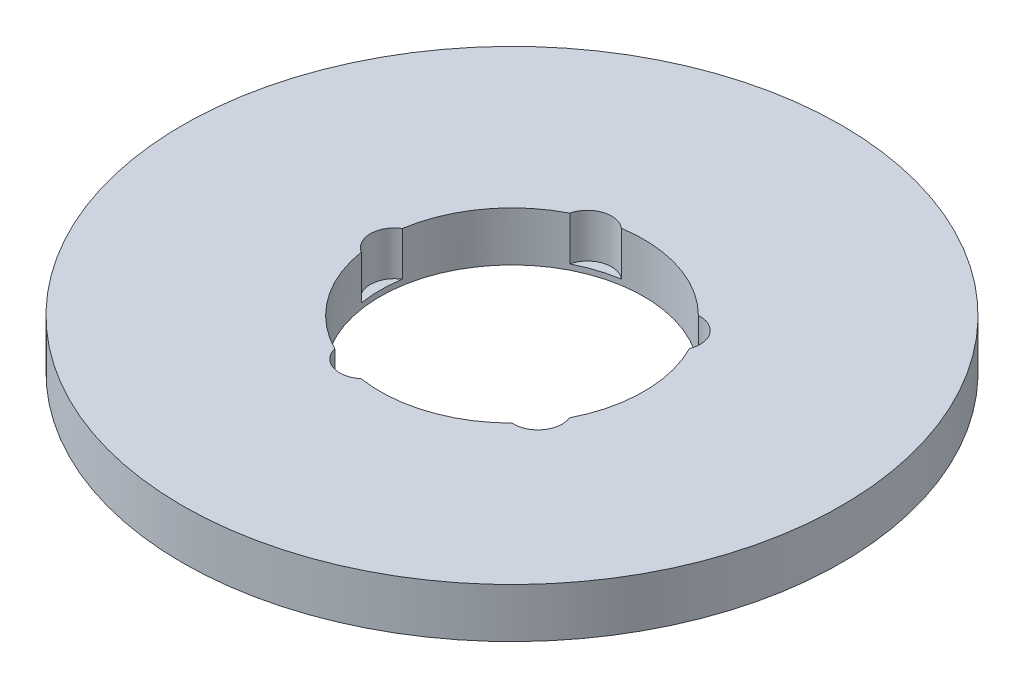
ISO-10303-21;
HEADER;
FILE_DESCRIPTION(('STEP AP214'),'2;1');
FILE_NAME('part.step','',(''),(''),'','','');
FILE_SCHEMA(('AUTOMOTIVE_DESIGN { 1 0 10303 214 1 1 1 1 }'));
ENDSEC;
DATA;
#1=APPLICATION_CONTEXT('core data for automotive mechanical design processes');
#2=APPLICATION_PROTOCOL_DEFINITION('international standard','automotive_design',2000,#1);
#3=PRODUCT_CONTEXT('',#1,'mechanical');
#4=PRODUCT('Part','Part','',(#3));
#5=PRODUCT_RELATED_PRODUCT_CATEGORY('part','',(#4));
#6=PRODUCT_DEFINITION_FORMATION('','',#4);
#7=PRODUCT_DEFINITION_CONTEXT('part definition',#1,'design');
#8=PRODUCT_DEFINITION('design','',#6,#7);
#9=PRODUCT_DEFINITION_SHAPE('','',#8);
#10=(LENGTH_UNIT() NAMED_UNIT(*) SI_UNIT(.MILLI.,.METRE.));
#11=(NAMED_UNIT(*) PLANE_ANGLE_UNIT() SI_UNIT($,.RADIAN.));
#12=(NAMED_UNIT(*) SI_UNIT($,.STERADIAN.) SOLID_ANGLE_UNIT());
#13=UNCERTAINTY_MEASURE_WITH_UNIT(LENGTH_MEASURE(1.E-05),#10,'distance_accuracy_value','');
#14=(GEOMETRIC_REPRESENTATION_CONTEXT(3) GLOBAL_UNCERTAINTY_ASSIGNED_CONTEXT((#13)) GLOBAL_UNIT_ASSIGNED_CONTEXT((#10,
#11,#12)) REPRESENTATION_CONTEXT('',''));
#15=CARTESIAN_POINT('',(0.,0.,0.));
#16=DIRECTION('',(0.,0.,1.));
#17=DIRECTION('',(1.,0.,0.));
#18=AXIS2_PLACEMENT_3D('',#15,#16,#17);
#19=CARTESIAN_POINT('',(0.,15.,0.));
#20=DIRECTION('',(0.,-1.,0.));
#21=DIRECTION('',(0.,0.,-1.));
#22=AXIS2_PLACEMENT_3D('',#19,#20,#21);
#23=CYLINDRICAL_SURFACE('',#22,100.);
#24=CARTESIAN_POINT('',(0.,15.,0.));
#25=DIRECTION('',(0.,1.,0.));
#26=DIRECTION('',(0.,0.,1.));
#27=AXIS2_PLACEMENT_3D('',#24,#25,#26);
#28=CIRCLE('',#27,100.);
#29=CARTESIAN_POINT('',(0.,15.,100.));
#30=VERTEX_POINT('',#29);
#31=EDGE_CURVE('E151',#30,#30,#28,.T.);
#32=ORIENTED_EDGE('',*,*,#31,.F.);
#33=EDGE_LOOP('',(#32));
#34=FACE_BOUND('',#33,.T.);
#35=CARTESIAN_POINT('',(0.,0.,0.));
#36=DIRECTION('',(0.,1.,0.));
#37=DIRECTION('',(0.,0.,1.));
#38=AXIS2_PLACEMENT_3D('',#35,#36,#37);
#39=CIRCLE('',#38,100.);
#40=CARTESIAN_POINT('',(0.,0.,100.));
#41=VERTEX_POINT('',#40);
#42=EDGE_CURVE('E150',#41,#41,#39,.T.);
#43=ORIENTED_EDGE('',*,*,#42,.T.);
#44=EDGE_LOOP('',(#43));
#45=FACE_BOUND('',#44,.T.);
#46=ADVANCED_FACE('F39',(#34,#45),#23,.T.);
#47=CARTESIAN_POINT('',(0.,15.,0.));
#48=DIRECTION('',(0.,1.,0.));
#49=DIRECTION('',(0.,0.,1.));
#50=AXIS2_PLACEMENT_3D('',#47,#48,#49);
#51=PLANE('',#50);
#52=CARTESIAN_POINT('',(-11.0185160792969,15.,-33.9115055413515));
#53=DIRECTION('',(0.,1.,0.));
#54=DIRECTION('',(-0.95105651629515,0.,0.309016994374958));
#55=AXIS2_PLACEMENT_3D('',#52,#53,#54);
#56=CIRCLE('',#55,7.31653374537758);
#57=CARTESIAN_POINT('',(-6.29754836445653,15.,-39.5011504211881));
#58=VERTEX_POINT('',#57);
#59=CARTESIAN_POINT('',(-18.1233700164183,15.,-35.658708042328));
#60=VERTEX_POINT('',#59);
#61=EDGE_CURVE('E196',#58,#60,#56,.T.);
#62=ORIENTED_EDGE('',*,*,#61,.F.);
#63=CARTESIAN_POINT('',(0.,15.,0.));
#64=DIRECTION('',(0.,1.,0.));
#65=DIRECTION('',(0.,0.,1.));
#66=AXIS2_PLACEMENT_3D('',#63,#64,#65);
#67=CIRCLE('',#66,40.);
#68=CARTESIAN_POINT('',(28.3130173159039,15.,-28.2554959338767));
#69=VERTEX_POINT('',#68);
#70=EDGE_CURVE('E156',#69,#58,#67,.T.);
#71=ORIENTED_EDGE('',*,*,#70,.F.);
#72=CARTESIAN_POINT('',(28.8468496011852,15.,-20.958463034236));
#73=DIRECTION('',(0.,1.,0.));
#74=DIRECTION('',(-0.58778525229248,0.,-0.809016994374942));
#75=AXIS2_PLACEMENT_3D('',#72,#73,#74);
#76=CIRCLE('',#75,7.31653374537758);
#77=CARTESIAN_POINT('',(35.6217770417108,15.,-18.1958511862084));
#78=VERTEX_POINT('',#77);
#79=EDGE_CURVE('E254',#78,#69,#76,.T.);
#80=ORIENTED_EDGE('',*,*,#79,.F.);
#81=CARTESIAN_POINT('',(35.6217770417111,15.,18.1958511862079));
#82=VERTEX_POINT('',#81);
#83=EDGE_CURVE('E153',#82,#78,#67,.T.);
#84=ORIENTED_EDGE('',*,*,#83,.F.);
#85=CARTESIAN_POINT('',(28.8468496011855,15.,20.9584630342355));
#86=DIRECTION('',(0.,1.,0.));
#87=DIRECTION('',(0.587785252292469,0.,-0.809016994374951));
#88=AXIS2_PLACEMENT_3D('',#85,#86,#87);
#89=CIRCLE('',#88,7.31653374537758);
#90=CARTESIAN_POINT('',(28.3130173159043,15.,28.2554959338763));
#91=VERTEX_POINT('',#90);
#92=EDGE_CURVE('E248',#91,#82,#89,.T.);
#93=ORIENTED_EDGE('',*,*,#92,.F.);
#94=CARTESIAN_POINT('',(-6.29754836445596,15.,39.5011504211882));
#95=VERTEX_POINT('',#94);
#96=EDGE_CURVE('E140',#95,#91,#67,.T.);
#97=ORIENTED_EDGE('',*,*,#96,.F.);
#98=CARTESIAN_POINT('',(-11.0185160792964,15.,33.9115055413516));
#99=DIRECTION('',(0.,1.,0.));
#100=DIRECTION('',(0.951056516295155,0.,0.309016994374945));
#101=AXIS2_PLACEMENT_3D('',#98,#99,#100);
#102=CIRCLE('',#101,7.31653374537758);
#103=CARTESIAN_POINT('',(-18.1233700164178,15.,35.6587080423283));
#104=VERTEX_POINT('',#103);
#105=EDGE_CURVE('E117',#104,#95,#102,.T.);
#106=ORIENTED_EDGE('',*,*,#105,.F.);
#107=CARTESIAN_POINT('',(-39.5138759767412,15.,6.21720236880842));
#108=VERTEX_POINT('',#107);
#109=EDGE_CURVE('E133',#108,#104,#67,.T.);
#110=ORIENTED_EDGE('',*,*,#109,.F.);
#111=CARTESIAN_POINT('',(-35.6566670437779,15.,0.));
#112=DIRECTION('',(0.,1.,0.));
#113=DIRECTION('',(0.,0.,1.));
#114=AXIS2_PLACEMENT_3D('',#111,#112,#113);
#115=CIRCLE('',#114,7.31653374537758);
#116=CARTESIAN_POINT('',(-39.5138759767412,15.,-6.21720236880842));
#117=VERTEX_POINT('',#116);
#118=EDGE_CURVE('E170',#117,#108,#115,.T.);
#119=ORIENTED_EDGE('',*,*,#118,.F.);
#120=EDGE_CURVE('E149',#60,#117,#67,.T.);
#121=ORIENTED_EDGE('',*,*,#120,.F.);
#122=EDGE_LOOP('',(#62,#71,#80,#84,#93,#97,#106,#110,#119,#121));
#123=FACE_BOUND('',#122,.T.);
#124=ORIENTED_EDGE('',*,*,#31,.T.);
#125=EDGE_LOOP('',(#124));
#126=FACE_BOUND('',#125,.T.);
#127=ADVANCED_FACE('F131',(#123,#126),#51,.T.);
#128=CARTESIAN_POINT('',(0.,0.,0.));
#129=DIRECTION('',(0.,1.,0.));
#130=DIRECTION('',(0.,0.,1.));
#131=AXIS2_PLACEMENT_3D('',#128,#129,#130);
#132=PLANE('',#131);
#133=CARTESIAN_POINT('',(0.,0.,0.));
#134=DIRECTION('',(0.,1.,0.));
#135=DIRECTION('',(0.,0.,1.));
#136=AXIS2_PLACEMENT_3D('',#133,#134,#135);
#137=CIRCLE('',#136,40.);
#138=CARTESIAN_POINT('',(0.,0.,40.));
#139=VERTEX_POINT('',#138);
#140=EDGE_CURVE('E160',#139,#139,#137,.T.);
#141=ORIENTED_EDGE('',*,*,#140,.T.);
#142=EDGE_LOOP('',(#141));
#143=FACE_BOUND('',#142,.T.);
#144=ORIENTED_EDGE('',*,*,#42,.F.);
#145=EDGE_LOOP('',(#144));
#146=FACE_BOUND('',#145,.T.);
#147=ADVANCED_FACE('F212',(#143,#146),#132,.F.);
#148=CARTESIAN_POINT('',(0.,15.,0.));
#149=DIRECTION('',(0.,-1.,0.));
#150=DIRECTION('',(0.,0.,-1.));
#151=AXIS2_PLACEMENT_3D('',#148,#149,#150);
#152=CYLINDRICAL_SURFACE('',#151,40.);
#153=DIRECTION('',(0.,1.,0.));
#154=VECTOR('',#153,1.);
#155=CARTESIAN_POINT('',(-6.29754836445653,8.32919586123089,-39.5011504211881));
#156=LINE('',#155,#154);
#157=CARTESIAN_POINT('',(-6.29754836445653,1.65839172246177,-39.5011504211881));
#158=VERTEX_POINT('',#157);
#159=EDGE_CURVE('E11',#158,#58,#156,.T.);
#160=ORIENTED_EDGE('',*,*,#159,.F.);
#161=CARTESIAN_POINT('',(0.,1.65839172246177,0.));
#162=DIRECTION('',(0.,1.,0.));
#163=DIRECTION('',(0.,0.,1.));
#164=AXIS2_PLACEMENT_3D('',#161,#162,#163);
#165=CIRCLE('',#164,40.);
#166=CARTESIAN_POINT('',(-18.1233700164183,1.65839172246177,-35.658708042328));
#167=VERTEX_POINT('',#166);
#168=EDGE_CURVE('E193',#158,#167,#165,.T.);
#169=ORIENTED_EDGE('',*,*,#168,.T.);
#170=DIRECTION('',(0.,1.,0.));
#171=VECTOR('',#170,1.);
#172=CARTESIAN_POINT('',(-18.1233700164183,8.32919586123089,-35.658708042328));
#173=LINE('',#172,#171);
#174=EDGE_CURVE('E46',#60,#167,#173,.F.);
#175=ORIENTED_EDGE('',*,*,#174,.F.);
#176=ORIENTED_EDGE('',*,*,#120,.T.);
#177=DIRECTION('',(0.,1.,0.));
#178=VECTOR('',#177,1.);
#179=CARTESIAN_POINT('',(-39.5138759767412,8.32919586123089,-6.21720236880842));
#180=LINE('',#179,#178);
#181=CARTESIAN_POINT('',(-39.5138759767412,1.65839172246177,-6.21720236880842));
#182=VERTEX_POINT('',#181);
#183=EDGE_CURVE('E174',#182,#117,#180,.T.);
#184=ORIENTED_EDGE('',*,*,#183,.F.);
#185=CARTESIAN_POINT('',(0.,1.65839172246177,0.));
#186=DIRECTION('',(0.,1.,0.));
#187=DIRECTION('',(0.,0.,1.));
#188=AXIS2_PLACEMENT_3D('',#185,#186,#187);
#189=CIRCLE('',#188,40.);
#190=CARTESIAN_POINT('',(-39.5138759767412,1.65839172246177,6.21720236880842));
#191=VERTEX_POINT('',#190);
#192=EDGE_CURVE('E171',#182,#191,#189,.T.);
#193=ORIENTED_EDGE('',*,*,#192,.T.);
#194=DIRECTION('',(0.,1.,0.));
#195=VECTOR('',#194,1.);
#196=CARTESIAN_POINT('',(-39.5138759767412,8.32919586123089,6.21720236880842));
#197=LINE('',#196,#195);
#198=EDGE_CURVE('E148',#108,#191,#197,.F.);
#199=ORIENTED_EDGE('',*,*,#198,.F.);
#200=ORIENTED_EDGE('',*,*,#109,.T.);
#201=DIRECTION('',(0.,1.,0.));
#202=VECTOR('',#201,1.);
#203=CARTESIAN_POINT('',(-18.1233700164178,8.32919586123089,35.6587080423283));
#204=LINE('',#203,#202);
#205=CARTESIAN_POINT('',(-18.1233700164178,1.65839172246177,35.6587080423283));
#206=VERTEX_POINT('',#205);
#207=EDGE_CURVE('E111',#206,#104,#204,.T.);
#208=ORIENTED_EDGE('',*,*,#207,.F.);
#209=CARTESIAN_POINT('',(0.,1.65839172246177,0.));
#210=DIRECTION('',(0.,1.,0.));
#211=DIRECTION('',(0.,0.,1.));
#212=AXIS2_PLACEMENT_3D('',#209,#210,#211);
#213=CIRCLE('',#212,40.);
#214=CARTESIAN_POINT('',(-6.29754836445596,1.65839172246177,39.5011504211882));
#215=VERTEX_POINT('',#214);
#216=EDGE_CURVE('E180',#206,#215,#213,.T.);
#217=ORIENTED_EDGE('',*,*,#216,.T.);
#218=DIRECTION('',(0.,1.,0.));
#219=VECTOR('',#218,1.);
#220=CARTESIAN_POINT('',(-6.29754836445597,8.32919586123089,39.5011504211882));
#221=LINE('',#220,#219);
#222=EDGE_CURVE('E124',#95,#215,#221,.F.);
#223=ORIENTED_EDGE('',*,*,#222,.F.);
#224=ORIENTED_EDGE('',*,*,#96,.T.);
#225=DIRECTION('',(0.,1.,0.));
#226=VECTOR('',#225,1.);
#227=CARTESIAN_POINT('',(28.3130173159043,8.32919586123089,28.2554959338763));
#228=LINE('',#227,#226);
#229=CARTESIAN_POINT('',(28.3130173159043,1.65839172246177,28.2554959338763));
#230=VERTEX_POINT('',#229);
#231=EDGE_CURVE('E183',#230,#91,#228,.T.);
#232=ORIENTED_EDGE('',*,*,#231,.F.);
#233=CARTESIAN_POINT('',(0.,1.65839172246177,0.));
#234=DIRECTION('',(0.,1.,0.));
#235=DIRECTION('',(0.,0.,1.));
#236=AXIS2_PLACEMENT_3D('',#233,#234,#235);
#237=CIRCLE('',#236,40.);
#238=CARTESIAN_POINT('',(35.6217770417111,1.65839172246177,18.1958511862079));
#239=VERTEX_POINT('',#238);
#240=EDGE_CURVE('E123',#230,#239,#237,.T.);
#241=ORIENTED_EDGE('',*,*,#240,.T.);
#242=DIRECTION('',(0.,1.,0.));
#243=VECTOR('',#242,1.);
#244=CARTESIAN_POINT('',(35.6217770417111,8.32919586123089,18.1958511862079));
#245=LINE('',#244,#243);
#246=EDGE_CURVE('E185',#82,#239,#245,.F.);
#247=ORIENTED_EDGE('',*,*,#246,.F.);
#248=ORIENTED_EDGE('',*,*,#83,.T.);
#249=DIRECTION('',(0.,1.,0.));
#250=VECTOR('',#249,1.);
#251=CARTESIAN_POINT('',(35.6217770417108,8.32919586123089,-18.1958511862084));
#252=LINE('',#251,#250);
#253=CARTESIAN_POINT('',(35.6217770417108,1.65839172246177,-18.1958511862084));
#254=VERTEX_POINT('',#253);
#255=EDGE_CURVE('E195',#254,#78,#252,.T.);
#256=ORIENTED_EDGE('',*,*,#255,.F.);
#257=CARTESIAN_POINT('',(0.,1.65839172246177,0.));
#258=DIRECTION('',(0.,1.,0.));
#259=DIRECTION('',(0.,0.,1.));
#260=AXIS2_PLACEMENT_3D('',#257,#258,#259);
#261=CIRCLE('',#260,40.);
#262=CARTESIAN_POINT('',(28.3130173159039,1.65839172246177,-28.2554959338767));
#263=VERTEX_POINT('',#262);
#264=EDGE_CURVE('E190',#254,#263,#261,.T.);
#265=ORIENTED_EDGE('',*,*,#264,.T.);
#266=DIRECTION('',(0.,1.,0.));
#267=VECTOR('',#266,1.);
#268=CARTESIAN_POINT('',(28.3130173159039,8.32919586123089,-28.2554959338767));
#269=LINE('',#268,#267);
#270=EDGE_CURVE('E189',#69,#263,#269,.F.);
#271=ORIENTED_EDGE('',*,*,#270,.F.);
#272=ORIENTED_EDGE('',*,*,#70,.T.);
#273=EDGE_LOOP('',(#160,#169,#175,#176,#184,#193,#199,#200,#208,#217,#223,#224,#232,#241,#247,
#248,#256,#265,#271,#272));
#274=FACE_BOUND('',#273,.T.);
#275=ORIENTED_EDGE('',*,*,#140,.F.);
#276=EDGE_LOOP('',(#275));
#277=FACE_BOUND('',#276,.T.);
#278=ADVANCED_FACE('F142',(#274,#277),#152,.F.);
#279=CARTESIAN_POINT('',(-35.6566670437779,1.65839172246177,0.));
#280=DIRECTION('',(0.,1.,0.));
#281=DIRECTION('',(0.,0.,1.));
#282=AXIS2_PLACEMENT_3D('',#279,#280,#281);
#283=CYLINDRICAL_SURFACE('',#282,7.31653374537758);
#284=ORIENTED_EDGE('',*,*,#183,.T.);
#285=ORIENTED_EDGE('',*,*,#118,.T.);
#286=ORIENTED_EDGE('',*,*,#198,.T.);
#287=CARTESIAN_POINT('',(-35.6566670437779,1.65839172246177,0.));
#288=DIRECTION('',(0.,1.,0.));
#289=DIRECTION('',(0.,0.,1.));
#290=AXIS2_PLACEMENT_3D('',#287,#288,#289);
#291=CIRCLE('',#290,7.31653374537758);
#292=EDGE_CURVE('E163',#182,#191,#291,.T.);
#293=ORIENTED_EDGE('',*,*,#292,.F.);
#294=EDGE_LOOP('',(#284,#285,#286,#293));
#295=FACE_BOUND('',#294,.T.);
#296=ADVANCED_FACE('F221',(#295),#283,.F.);
#297=CARTESIAN_POINT('',(-35.6566670437779,1.65839172246177,0.));
#298=DIRECTION('',(0.,1.,0.));
#299=DIRECTION('',(0.,0.,1.));
#300=AXIS2_PLACEMENT_3D('',#297,#298,#299);
#301=PLANE('',#300);
#302=ORIENTED_EDGE('',*,*,#292,.T.);
#303=ORIENTED_EDGE('',*,*,#192,.F.);
#304=EDGE_LOOP('',(#302,#303));
#305=FACE_BOUND('',#304,.T.);
#306=ADVANCED_FACE('F227',(#305),#301,.T.);
#307=CARTESIAN_POINT('',(-11.0185160792964,1.65839172246177,33.9115055413516));
#308=DIRECTION('',(0.,1.,0.));
#309=DIRECTION('',(0.,0.,1.));
#310=AXIS2_PLACEMENT_3D('',#307,#308,#309);
#311=CYLINDRICAL_SURFACE('',#310,7.31653374537758);
#312=ORIENTED_EDGE('',*,*,#207,.T.);
#313=ORIENTED_EDGE('',*,*,#105,.T.);
#314=ORIENTED_EDGE('',*,*,#222,.T.);
#315=CARTESIAN_POINT('',(-11.0185160792964,1.65839172246177,33.9115055413516));
#316=DIRECTION('',(0.,1.,0.));
#317=DIRECTION('',(0.951056516295155,0.,0.309016994374945));
#318=AXIS2_PLACEMENT_3D('',#315,#316,#317);
#319=CIRCLE('',#318,7.31653374537758);
#320=EDGE_CURVE('E119',#206,#215,#319,.T.);
#321=ORIENTED_EDGE('',*,*,#320,.F.);
#322=EDGE_LOOP('',(#312,#313,#314,#321));
#323=FACE_BOUND('',#322,.T.);
#324=ADVANCED_FACE('F116',(#323),#311,.F.);
#325=CARTESIAN_POINT('',(-11.0185160792964,1.65839172246177,33.9115055413516));
#326=DIRECTION('',(0.,1.,0.));
#327=DIRECTION('',(0.951056516295155,0.,0.309016994374945));
#328=AXIS2_PLACEMENT_3D('',#325,#326,#327);
#329=PLANE('',#328);
#330=ORIENTED_EDGE('',*,*,#320,.T.);
#331=ORIENTED_EDGE('',*,*,#216,.F.);
#332=EDGE_LOOP('',(#330,#331));
#333=FACE_BOUND('',#332,.T.);
#334=ADVANCED_FACE('F234',(#333),#329,.T.);
#335=CARTESIAN_POINT('',(28.8468496011855,1.65839172246177,20.9584630342355));
#336=DIRECTION('',(0.,1.,0.));
#337=DIRECTION('',(0.,0.,1.));
#338=AXIS2_PLACEMENT_3D('',#335,#336,#337);
#339=CYLINDRICAL_SURFACE('',#338,7.31653374537758);
#340=ORIENTED_EDGE('',*,*,#231,.T.);
#341=ORIENTED_EDGE('',*,*,#92,.T.);
#342=ORIENTED_EDGE('',*,*,#246,.T.);
#343=CARTESIAN_POINT('',(28.8468496011855,1.65839172246177,20.9584630342355));
#344=DIRECTION('',(0.,1.,0.));
#345=DIRECTION('',(0.587785252292469,0.,-0.809016994374951));
#346=AXIS2_PLACEMENT_3D('',#343,#344,#345);
#347=CIRCLE('',#346,7.31653374537758);
#348=EDGE_CURVE('E137',#230,#239,#347,.T.);
#349=ORIENTED_EDGE('',*,*,#348,.F.);
#350=EDGE_LOOP('',(#340,#341,#342,#349));
#351=FACE_BOUND('',#350,.T.);
#352=ADVANCED_FACE('F240',(#351),#339,.F.);
#353=CARTESIAN_POINT('',(28.8468496011855,1.65839172246177,20.9584630342355));
#354=DIRECTION('',(0.,1.,0.));
#355=DIRECTION('',(0.587785252292469,0.,-0.809016994374951));
#356=AXIS2_PLACEMENT_3D('',#353,#354,#355);
#357=PLANE('',#356);
#358=ORIENTED_EDGE('',*,*,#348,.T.);
#359=ORIENTED_EDGE('',*,*,#240,.F.);
#360=EDGE_LOOP('',(#358,#359));
#361=FACE_BOUND('',#360,.T.);
#362=ADVANCED_FACE('F245',(#361),#357,.T.);
#363=CARTESIAN_POINT('',(28.8468496011852,1.65839172246177,-20.958463034236));
#364=DIRECTION('',(0.,1.,0.));
#365=DIRECTION('',(0.,0.,1.));
#366=AXIS2_PLACEMENT_3D('',#363,#364,#365);
#367=CYLINDRICAL_SURFACE('',#366,7.31653374537758);
#368=ORIENTED_EDGE('',*,*,#255,.T.);
#369=ORIENTED_EDGE('',*,*,#79,.T.);
#370=ORIENTED_EDGE('',*,*,#270,.T.);
#371=CARTESIAN_POINT('',(28.8468496011852,1.65839172246177,-20.958463034236));
#372=DIRECTION('',(0.,1.,0.));
#373=DIRECTION('',(-0.58778525229248,0.,-0.809016994374942));
#374=AXIS2_PLACEMENT_3D('',#371,#372,#373);
#375=CIRCLE('',#374,7.31653374537758);
#376=EDGE_CURVE('E56',#254,#263,#375,.T.);
#377=ORIENTED_EDGE('',*,*,#376,.F.);
#378=EDGE_LOOP('',(#368,#369,#370,#377));
#379=FACE_BOUND('',#378,.T.);
#380=ADVANCED_FACE('F264',(#379),#367,.F.);
#381=CARTESIAN_POINT('',(28.8468496011852,1.65839172246177,-20.958463034236));
#382=DIRECTION('',(0.,1.,0.));
#383=DIRECTION('',(-0.58778525229248,0.,-0.809016994374942));
#384=AXIS2_PLACEMENT_3D('',#381,#382,#383);
#385=PLANE('',#384);
#386=ORIENTED_EDGE('',*,*,#376,.T.);
#387=ORIENTED_EDGE('',*,*,#264,.F.);
#388=EDGE_LOOP('',(#386,#387));
#389=FACE_BOUND('',#388,.T.);
#390=ADVANCED_FACE('F202',(#389),#385,.T.);
#391=CARTESIAN_POINT('',(-11.0185160792969,1.65839172246177,-33.9115055413515));
#392=DIRECTION('',(0.,1.,0.));
#393=DIRECTION('',(0.,0.,1.));
#394=AXIS2_PLACEMENT_3D('',#391,#392,#393);
#395=CYLINDRICAL_SURFACE('',#394,7.31653374537758);
#396=ORIENTED_EDGE('',*,*,#159,.T.);
#397=ORIENTED_EDGE('',*,*,#61,.T.);
#398=ORIENTED_EDGE('',*,*,#174,.T.);
#399=CARTESIAN_POINT('',(-11.0185160792969,1.65839172246177,-33.9115055413515));
#400=DIRECTION('',(0.,1.,0.));
#401=DIRECTION('',(-0.95105651629515,0.,0.309016994374958));
#402=AXIS2_PLACEMENT_3D('',#399,#400,#401);
#403=CIRCLE('',#402,7.31653374537758);
#404=EDGE_CURVE('E55',#158,#167,#403,.T.);
#405=ORIENTED_EDGE('',*,*,#404,.F.);
#406=EDGE_LOOP('',(#396,#397,#398,#405));
#407=FACE_BOUND('',#406,.T.);
#408=ADVANCED_FACE('F197',(#407),#395,.F.);
#409=CARTESIAN_POINT('',(-11.0185160792969,1.65839172246177,-33.9115055413515));
#410=DIRECTION('',(0.,1.,0.));
#411=DIRECTION('',(-0.95105651629515,0.,0.309016994374958));
#412=AXIS2_PLACEMENT_3D('',#409,#410,#411);
#413=PLANE('',#412);
#414=ORIENTED_EDGE('',*,*,#404,.T.);
#415=ORIENTED_EDGE('',*,*,#168,.F.);
#416=EDGE_LOOP('',(#414,#415));
#417=FACE_BOUND('',#416,.T.);
#418=ADVANCED_FACE('F200',(#417),#413,.T.);
#419=CLOSED_SHELL('',(#46,#127,#147,#278,#296,#306,#324,#334,#352,#362,#380,#390,#408,#418));
#420=MANIFOLD_SOLID_BREP('B2',#419);
#421=ADVANCED_BREP_SHAPE_REPRESENTATION('',(#18,#420),#14);
#422=SHAPE_DEFINITION_REPRESENTATION(#9,#421);
ENDSEC;
END-ISO-10303-21;
